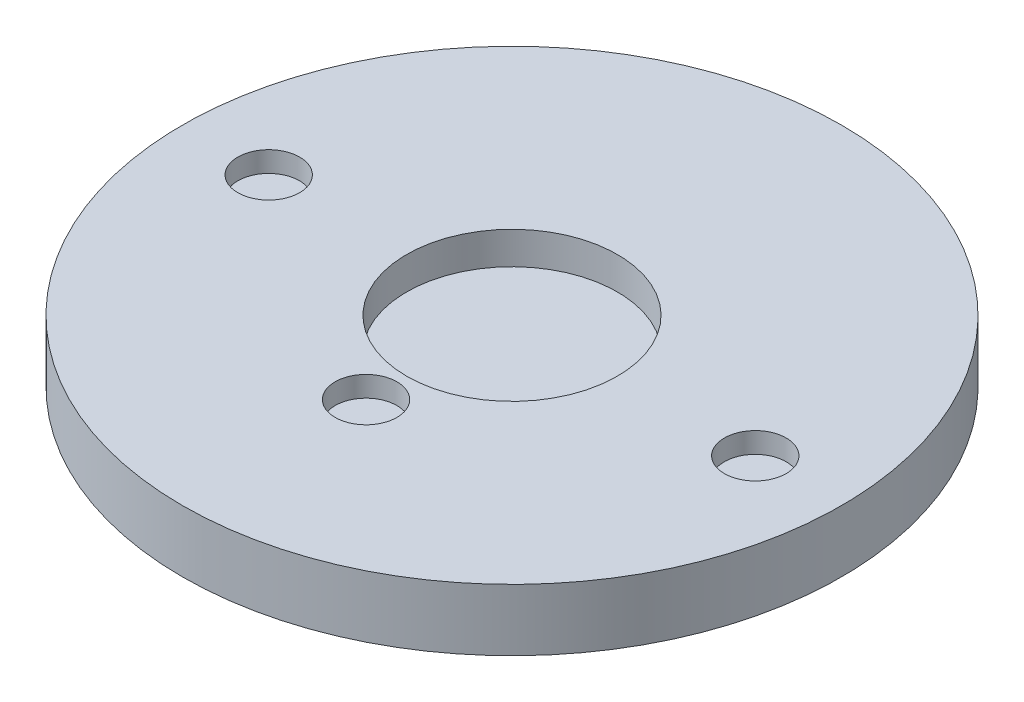
ISO-10303-21;
HEADER;
FILE_DESCRIPTION(('STEP AP214'),'2;1');
FILE_NAME('part.step','',(''),(''),'','','');
FILE_SCHEMA(('AUTOMOTIVE_DESIGN { 1 0 10303 214 1 1 1 1 }'));
ENDSEC;
DATA;
#1=APPLICATION_CONTEXT('core data for automotive mechanical design processes');
#2=APPLICATION_PROTOCOL_DEFINITION('international standard','automotive_design',2000,#1);
#3=PRODUCT_CONTEXT('',#1,'mechanical');
#4=PRODUCT('Part','Part','',(#3));
#5=PRODUCT_RELATED_PRODUCT_CATEGORY('part','',(#4));
#6=PRODUCT_DEFINITION_FORMATION('','',#4);
#7=PRODUCT_DEFINITION_CONTEXT('part definition',#1,'design');
#8=PRODUCT_DEFINITION('design','',#6,#7);
#9=PRODUCT_DEFINITION_SHAPE('','',#8);
#10=(LENGTH_UNIT() NAMED_UNIT(*) SI_UNIT(.MILLI.,.METRE.));
#11=(NAMED_UNIT(*) PLANE_ANGLE_UNIT() SI_UNIT($,.RADIAN.));
#12=(NAMED_UNIT(*) SI_UNIT($,.STERADIAN.) SOLID_ANGLE_UNIT());
#13=UNCERTAINTY_MEASURE_WITH_UNIT(LENGTH_MEASURE(1.E-05),#10,'distance_accuracy_value','');
#14=(GEOMETRIC_REPRESENTATION_CONTEXT(3) GLOBAL_UNCERTAINTY_ASSIGNED_CONTEXT((#13)) GLOBAL_UNIT_ASSIGNED_CONTEXT((#10,
#11,#12)) REPRESENTATION_CONTEXT('',''));
#15=CARTESIAN_POINT('',(0.,0.,0.));
#16=DIRECTION('',(0.,0.,1.));
#17=DIRECTION('',(1.,0.,0.));
#18=AXIS2_PLACEMENT_3D('',#15,#16,#17);
#19=CARTESIAN_POINT('',(0.,19.05,0.));
#20=DIRECTION('',(0.,-1.,0.));
#21=DIRECTION('',(0.,0.,-1.));
#22=AXIS2_PLACEMENT_3D('',#19,#20,#21);
#23=CYLINDRICAL_SURFACE('',#22,101.6);
#24=CARTESIAN_POINT('',(0.,19.05,0.));
#25=DIRECTION('',(0.,1.,0.));
#26=DIRECTION('',(0.,0.,1.));
#27=AXIS2_PLACEMENT_3D('',#24,#25,#26);
#28=CIRCLE('',#27,101.6);
#29=CARTESIAN_POINT('',(0.,19.05,101.6));
#30=VERTEX_POINT('',#29);
#31=EDGE_CURVE('E10',#30,#30,#28,.T.);
#32=ORIENTED_EDGE('',*,*,#31,.F.);
#33=EDGE_LOOP('',(#32));
#34=FACE_BOUND('',#33,.T.);
#35=CARTESIAN_POINT('',(0.,0.,0.));
#36=DIRECTION('',(0.,1.,0.));
#37=DIRECTION('',(0.,0.,1.));
#38=AXIS2_PLACEMENT_3D('',#35,#36,#37);
#39=CIRCLE('',#38,101.6);
#40=CARTESIAN_POINT('',(0.,0.,101.6));
#41=VERTEX_POINT('',#40);
#42=EDGE_CURVE('E40',#41,#41,#39,.T.);
#43=ORIENTED_EDGE('',*,*,#42,.T.);
#44=EDGE_LOOP('',(#43));
#45=FACE_BOUND('',#44,.T.);
#46=ADVANCED_FACE('F37',(#34,#45),#23,.T.);
#47=CARTESIAN_POINT('',(0.,19.05,0.));
#48=DIRECTION('',(0.,1.,0.));
#49=DIRECTION('',(0.,0.,1.));
#50=AXIS2_PLACEMENT_3D('',#47,#48,#49);
#51=PLANE('',#50);
#52=CARTESIAN_POINT('',(0.,19.05,45.));
#53=DIRECTION('',(0.,1.,0.));
#54=DIRECTION('',(0.,0.,1.));
#55=AXIS2_PLACEMENT_3D('',#52,#53,#54);
#56=CIRCLE('',#55,9.525);
#57=CARTESIAN_POINT('',(0.,19.05,54.525));
#58=VERTEX_POINT('',#57);
#59=EDGE_CURVE('E75',#58,#58,#56,.T.);
#60=ORIENTED_EDGE('',*,*,#59,.F.);
#61=EDGE_LOOP('',(#60));
#62=FACE_BOUND('',#61,.T.);
#63=CARTESIAN_POINT('',(75.,19.05,0.));
#64=DIRECTION('',(0.,1.,0.));
#65=DIRECTION('',(0.,0.,1.));
#66=AXIS2_PLACEMENT_3D('',#63,#64,#65);
#67=CIRCLE('',#66,9.52500000000001);
#68=CARTESIAN_POINT('',(75.,19.05,9.52500000000001));
#69=VERTEX_POINT('',#68);
#70=EDGE_CURVE('E67',#69,#69,#67,.T.);
#71=ORIENTED_EDGE('',*,*,#70,.F.);
#72=EDGE_LOOP('',(#71));
#73=FACE_BOUND('',#72,.T.);
#74=CARTESIAN_POINT('',(-75.,19.05,0.));
#75=DIRECTION('',(0.,1.,0.));
#76=DIRECTION('',(0.,0.,1.));
#77=AXIS2_PLACEMENT_3D('',#74,#75,#76);
#78=CIRCLE('',#77,9.52500000000001);
#79=CARTESIAN_POINT('',(-75.,19.05,9.52500000000001));
#80=VERTEX_POINT('',#79);
#81=EDGE_CURVE('E59',#80,#80,#78,.T.);
#82=ORIENTED_EDGE('',*,*,#81,.F.);
#83=EDGE_LOOP('',(#82));
#84=FACE_BOUND('',#83,.T.);
#85=CARTESIAN_POINT('',(0.,19.05,0.));
#86=DIRECTION('',(0.,1.,0.));
#87=DIRECTION('',(0.,0.,1.));
#88=AXIS2_PLACEMENT_3D('',#85,#86,#87);
#89=CIRCLE('',#88,32.5);
#90=CARTESIAN_POINT('',(0.,19.05,32.5));
#91=VERTEX_POINT('',#90);
#92=EDGE_CURVE('E51',#91,#91,#89,.T.);
#93=ORIENTED_EDGE('',*,*,#92,.F.);
#94=EDGE_LOOP('',(#93));
#95=FACE_BOUND('',#94,.T.);
#96=ORIENTED_EDGE('',*,*,#31,.T.);
#97=EDGE_LOOP('',(#96));
#98=FACE_BOUND('',#97,.T.);
#99=ADVANCED_FACE('F92',(#62,#73,#84,#95,#98),#51,.T.);
#100=CARTESIAN_POINT('',(0.,0.,0.));
#101=DIRECTION('',(0.,1.,0.));
#102=DIRECTION('',(0.,0.,1.));
#103=AXIS2_PLACEMENT_3D('',#100,#101,#102);
#104=PLANE('',#103);
#105=ORIENTED_EDGE('',*,*,#42,.F.);
#106=EDGE_LOOP('',(#105));
#107=FACE_BOUND('',#106,.T.);
#108=ADVANCED_FACE('F95',(#107),#104,.F.);
#109=CARTESIAN_POINT('',(0.,9.05,0.));
#110=DIRECTION('',(0.,1.,0.));
#111=DIRECTION('',(0.,0.,1.));
#112=AXIS2_PLACEMENT_3D('',#109,#110,#111);
#113=CYLINDRICAL_SURFACE('',#112,32.5);
#114=CARTESIAN_POINT('',(0.,9.05,0.));
#115=DIRECTION('',(0.,1.,0.));
#116=DIRECTION('',(0.,0.,1.));
#117=AXIS2_PLACEMENT_3D('',#114,#115,#116);
#118=CIRCLE('',#117,32.5);
#119=CARTESIAN_POINT('',(0.,9.05,32.5));
#120=VERTEX_POINT('',#119);
#121=EDGE_CURVE('E49',#120,#120,#118,.T.);
#122=ORIENTED_EDGE('',*,*,#121,.F.);
#123=EDGE_LOOP('',(#122));
#124=FACE_BOUND('',#123,.T.);
#125=ORIENTED_EDGE('',*,*,#92,.T.);
#126=EDGE_LOOP('',(#125));
#127=FACE_BOUND('',#126,.T.);
#128=ADVANCED_FACE('F103',(#124,#127),#113,.F.);
#129=CARTESIAN_POINT('',(0.,9.05,0.));
#130=DIRECTION('',(0.,1.,0.));
#131=DIRECTION('',(0.,0.,1.));
#132=AXIS2_PLACEMENT_3D('',#129,#130,#131);
#133=PLANE('',#132);
#134=ORIENTED_EDGE('',*,*,#121,.T.);
#135=EDGE_LOOP('',(#134));
#136=FACE_BOUND('',#135,.T.);
#137=ADVANCED_FACE('F105',(#136),#133,.T.);
#138=CARTESIAN_POINT('',(-75.,12.7,0.));
#139=DIRECTION('',(0.,1.,0.));
#140=DIRECTION('',(0.,0.,1.));
#141=AXIS2_PLACEMENT_3D('',#138,#139,#140);
#142=CYLINDRICAL_SURFACE('',#141,9.52500000000001);
#143=CARTESIAN_POINT('',(-75.,12.7,0.));
#144=DIRECTION('',(0.,1.,0.));
#145=DIRECTION('',(0.,0.,1.));
#146=AXIS2_PLACEMENT_3D('',#143,#144,#145);
#147=CIRCLE('',#146,9.52500000000001);
#148=CARTESIAN_POINT('',(-75.,12.7,9.52500000000001));
#149=VERTEX_POINT('',#148);
#150=EDGE_CURVE('E55',#149,#149,#147,.T.);
#151=ORIENTED_EDGE('',*,*,#150,.F.);
#152=EDGE_LOOP('',(#151));
#153=FACE_BOUND('',#152,.T.);
#154=ORIENTED_EDGE('',*,*,#81,.T.);
#155=EDGE_LOOP('',(#154));
#156=FACE_BOUND('',#155,.T.);
#157=ADVANCED_FACE('F112',(#153,#156),#142,.F.);
#158=CARTESIAN_POINT('',(-75.,12.7,0.));
#159=DIRECTION('',(0.,1.,0.));
#160=DIRECTION('',(0.,0.,1.));
#161=AXIS2_PLACEMENT_3D('',#158,#159,#160);
#162=PLANE('',#161);
#163=ORIENTED_EDGE('',*,*,#150,.T.);
#164=EDGE_LOOP('',(#163));
#165=FACE_BOUND('',#164,.T.);
#166=ADVANCED_FACE('F152',(#165),#162,.T.);
#167=CARTESIAN_POINT('',(75.,12.7,0.));
#168=DIRECTION('',(0.,1.,0.));
#169=DIRECTION('',(0.,0.,1.));
#170=AXIS2_PLACEMENT_3D('',#167,#168,#169);
#171=CYLINDRICAL_SURFACE('',#170,9.52500000000001);
#172=CARTESIAN_POINT('',(75.,12.7,0.));
#173=DIRECTION('',(0.,1.,0.));
#174=DIRECTION('',(0.,0.,1.));
#175=AXIS2_PLACEMENT_3D('',#172,#173,#174);
#176=CIRCLE('',#175,9.52500000000001);
#177=CARTESIAN_POINT('',(75.,12.7,9.52500000000001));
#178=VERTEX_POINT('',#177);
#179=EDGE_CURVE('E63',#178,#178,#176,.T.);
#180=ORIENTED_EDGE('',*,*,#179,.F.);
#181=EDGE_LOOP('',(#180));
#182=FACE_BOUND('',#181,.T.);
#183=ORIENTED_EDGE('',*,*,#70,.T.);
#184=EDGE_LOOP('',(#183));
#185=FACE_BOUND('',#184,.T.);
#186=ADVANCED_FACE('F162',(#182,#185),#171,.F.);
#187=CARTESIAN_POINT('',(75.,12.7,0.));
#188=DIRECTION('',(0.,1.,0.));
#189=DIRECTION('',(0.,0.,1.));
#190=AXIS2_PLACEMENT_3D('',#187,#188,#189);
#191=PLANE('',#190);
#192=ORIENTED_EDGE('',*,*,#179,.T.);
#193=EDGE_LOOP('',(#192));
#194=FACE_BOUND('',#193,.T.);
#195=ADVANCED_FACE('F88',(#194),#191,.T.);
#196=CARTESIAN_POINT('',(0.,12.7,45.));
#197=DIRECTION('',(0.,1.,0.));
#198=DIRECTION('',(0.,0.,1.));
#199=AXIS2_PLACEMENT_3D('',#196,#197,#198);
#200=CYLINDRICAL_SURFACE('',#199,9.525);
#201=CARTESIAN_POINT('',(0.,12.7,45.));
#202=DIRECTION('',(0.,1.,0.));
#203=DIRECTION('',(0.,0.,1.));
#204=AXIS2_PLACEMENT_3D('',#201,#202,#203);
#205=CIRCLE('',#204,9.525);
#206=CARTESIAN_POINT('',(0.,12.7,54.525));
#207=VERTEX_POINT('',#206);
#208=EDGE_CURVE('E71',#207,#207,#205,.T.);
#209=ORIENTED_EDGE('',*,*,#208,.F.);
#210=EDGE_LOOP('',(#209));
#211=FACE_BOUND('',#210,.T.);
#212=ORIENTED_EDGE('',*,*,#59,.T.);
#213=EDGE_LOOP('',(#212));
#214=FACE_BOUND('',#213,.T.);
#215=ADVANCED_FACE('F85',(#211,#214),#200,.F.);
#216=CARTESIAN_POINT('',(0.,12.7,45.));
#217=DIRECTION('',(0.,1.,0.));
#218=DIRECTION('',(0.,0.,1.));
#219=AXIS2_PLACEMENT_3D('',#216,#217,#218);
#220=PLANE('',#219);
#221=ORIENTED_EDGE('',*,*,#208,.T.);
#222=EDGE_LOOP('',(#221));
#223=FACE_BOUND('',#222,.T.);
#224=ADVANCED_FACE('F83',(#223),#220,.T.);
#225=CLOSED_SHELL('',(#46,#99,#108,#128,#137,#157,#166,#186,#195,#215,#224));
#226=MANIFOLD_SOLID_BREP('B2',#225);
#227=ADVANCED_BREP_SHAPE_REPRESENTATION('',(#18,#226),#14);
#228=SHAPE_DEFINITION_REPRESENTATION(#9,#227);
ENDSEC;
END-ISO-10303-21;
